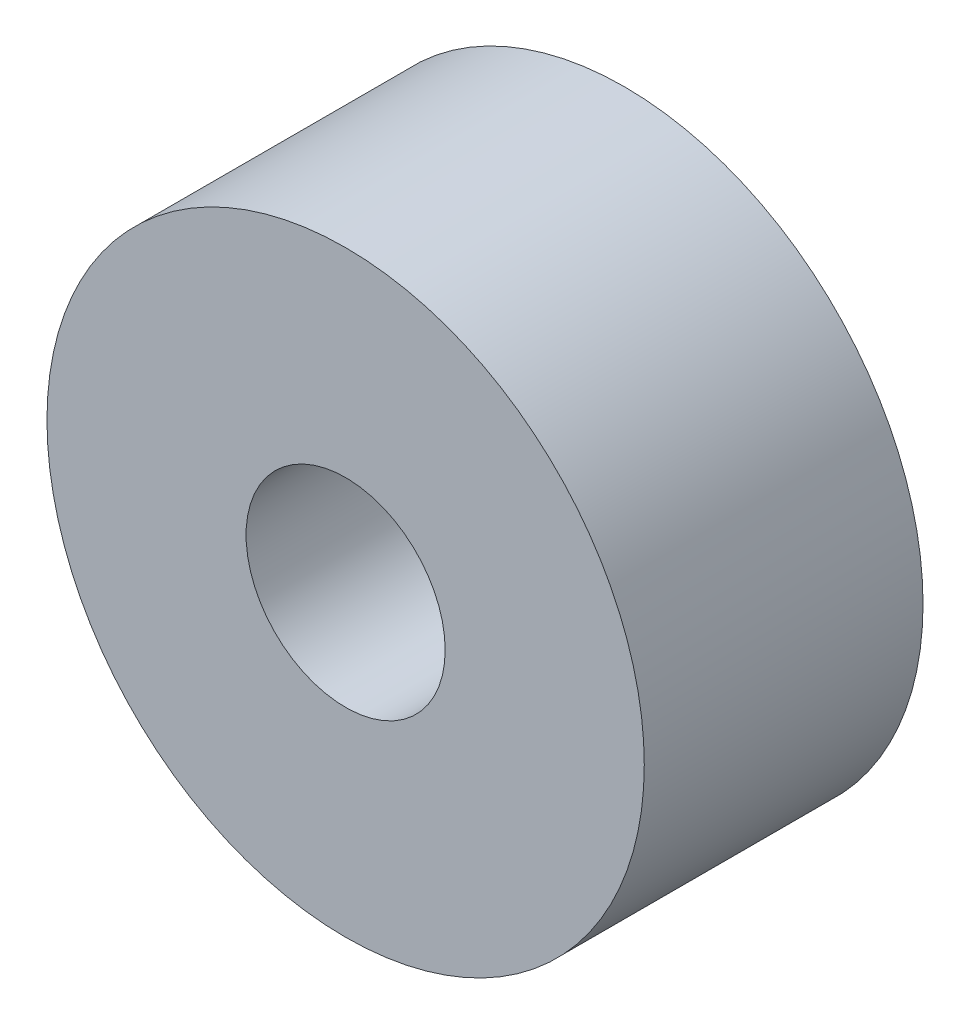
ISO-10303-21;
HEADER;
FILE_DESCRIPTION(('STEP AP214'),'2;1');
FILE_NAME('part.step','',(''),(''),'','','');
FILE_SCHEMA(('AUTOMOTIVE_DESIGN { 1 0 10303 214 1 1 1 1 }'));
ENDSEC;
DATA;
#1=APPLICATION_CONTEXT('core data for automotive mechanical design processes');
#2=APPLICATION_PROTOCOL_DEFINITION('international standard','automotive_design',2000,#1);
#3=PRODUCT_CONTEXT('',#1,'mechanical');
#4=PRODUCT('Part','Part','',(#3));
#5=PRODUCT_RELATED_PRODUCT_CATEGORY('part','',(#4));
#6=PRODUCT_DEFINITION_FORMATION('','',#4);
#7=PRODUCT_DEFINITION_CONTEXT('part definition',#1,'design');
#8=PRODUCT_DEFINITION('design','',#6,#7);
#9=PRODUCT_DEFINITION_SHAPE('','',#8);
#10=(LENGTH_UNIT() NAMED_UNIT(*) SI_UNIT(.MILLI.,.METRE.));
#11=(NAMED_UNIT(*) PLANE_ANGLE_UNIT() SI_UNIT($,.RADIAN.));
#12=(NAMED_UNIT(*) SI_UNIT($,.STERADIAN.) SOLID_ANGLE_UNIT());
#13=UNCERTAINTY_MEASURE_WITH_UNIT(LENGTH_MEASURE(1.E-05),#10,'distance_accuracy_value','');
#14=(GEOMETRIC_REPRESENTATION_CONTEXT(3) GLOBAL_UNCERTAINTY_ASSIGNED_CONTEXT((#13)) GLOBAL_UNIT_ASSIGNED_CONTEXT((#10,
#11,#12)) REPRESENTATION_CONTEXT('',''));
#15=CARTESIAN_POINT('',(0.,0.,0.));
#16=DIRECTION('',(0.,0.,1.));
#17=DIRECTION('',(1.,0.,0.));
#18=AXIS2_PLACEMENT_3D('',#15,#16,#17);
#19=CARTESIAN_POINT('',(0.,0.,2.8));
#20=DIRECTION('',(0.,0.,1.));
#21=DIRECTION('',(1.,0.,0.));
#22=AXIS2_PLACEMENT_3D('',#19,#20,#21);
#23=PLANE('',#22);
#24=CARTESIAN_POINT('',(0.,0.,2.8));
#25=DIRECTION('',(0.,0.,1.));
#26=DIRECTION('',(1.,0.,0.));
#27=AXIS2_PLACEMENT_3D('',#24,#25,#26);
#28=CIRCLE('',#27,3.);
#29=CARTESIAN_POINT('',(3.,0.,2.8));
#30=VERTEX_POINT('',#29);
#31=EDGE_CURVE('E10',#30,#30,#28,.T.);
#32=ORIENTED_EDGE('',*,*,#31,.T.);
#33=EDGE_LOOP('',(#32));
#34=FACE_BOUND('',#33,.T.);
#35=CARTESIAN_POINT('',(0.,0.,2.8));
#36=DIRECTION('',(0.,0.,1.));
#37=DIRECTION('',(1.,0.,0.));
#38=AXIS2_PLACEMENT_3D('',#35,#36,#37);
#39=CIRCLE('',#38,1.);
#40=CARTESIAN_POINT('',(1.,0.,2.8));
#41=VERTEX_POINT('',#40);
#42=EDGE_CURVE('E50',#41,#41,#39,.T.);
#43=ORIENTED_EDGE('',*,*,#42,.F.);
#44=EDGE_LOOP('',(#43));
#45=FACE_BOUND('',#44,.T.);
#46=ADVANCED_FACE('F37',(#34,#45),#23,.T.);
#47=CARTESIAN_POINT('',(0.,0.,0.));
#48=DIRECTION('',(0.,0.,1.));
#49=DIRECTION('',(1.,0.,0.));
#50=AXIS2_PLACEMENT_3D('',#47,#48,#49);
#51=PLANE('',#50);
#52=CARTESIAN_POINT('',(0.,0.,0.));
#53=DIRECTION('',(0.,0.,1.));
#54=DIRECTION('',(1.,0.,0.));
#55=AXIS2_PLACEMENT_3D('',#52,#53,#54);
#56=CIRCLE('',#55,3.);
#57=CARTESIAN_POINT('',(3.,0.,0.));
#58=VERTEX_POINT('',#57);
#59=EDGE_CURVE('E41',#58,#58,#56,.T.);
#60=ORIENTED_EDGE('',*,*,#59,.F.);
#61=EDGE_LOOP('',(#60));
#62=FACE_BOUND('',#61,.T.);
#63=CARTESIAN_POINT('',(0.,0.,0.));
#64=DIRECTION('',(0.,0.,1.));
#65=DIRECTION('',(1.,0.,0.));
#66=AXIS2_PLACEMENT_3D('',#63,#64,#65);
#67=CIRCLE('',#66,1.);
#68=CARTESIAN_POINT('',(1.,0.,0.));
#69=VERTEX_POINT('',#68);
#70=EDGE_CURVE('E52',#69,#69,#67,.T.);
#71=ORIENTED_EDGE('',*,*,#70,.T.);
#72=EDGE_LOOP('',(#71));
#73=FACE_BOUND('',#72,.T.);
#74=ADVANCED_FACE('F64',(#62,#73),#51,.F.);
#75=CARTESIAN_POINT('',(0.,0.,2.8));
#76=DIRECTION('',(0.,0.,-1.));
#77=DIRECTION('',(-1.,0.,0.));
#78=AXIS2_PLACEMENT_3D('',#75,#76,#77);
#79=CYLINDRICAL_SURFACE('',#78,3.);
#80=ORIENTED_EDGE('',*,*,#31,.F.);
#81=EDGE_LOOP('',(#80));
#82=FACE_BOUND('',#81,.T.);
#83=ORIENTED_EDGE('',*,*,#59,.T.);
#84=EDGE_LOOP('',(#83));
#85=FACE_BOUND('',#84,.T.);
#86=ADVANCED_FACE('F39',(#82,#85),#79,.T.);
#87=CARTESIAN_POINT('',(0.,0.,2.8));
#88=DIRECTION('',(0.,0.,-1.));
#89=DIRECTION('',(-1.,0.,0.));
#90=AXIS2_PLACEMENT_3D('',#87,#88,#89);
#91=CYLINDRICAL_SURFACE('',#90,1.);
#92=ORIENTED_EDGE('',*,*,#42,.T.);
#93=EDGE_LOOP('',(#92));
#94=FACE_BOUND('',#93,.T.);
#95=ORIENTED_EDGE('',*,*,#70,.F.);
#96=EDGE_LOOP('',(#95));
#97=FACE_BOUND('',#96,.T.);
#98=ADVANCED_FACE('F60',(#94,#97),#91,.F.);
#99=CLOSED_SHELL('',(#46,#74,#86,#98));
#100=MANIFOLD_SOLID_BREP('B2',#99);
#101=ADVANCED_BREP_SHAPE_REPRESENTATION('',(#18,#100),#14);
#102=SHAPE_DEFINITION_REPRESENTATION(#9,#101);
ENDSEC;
END-ISO-10303-21;
